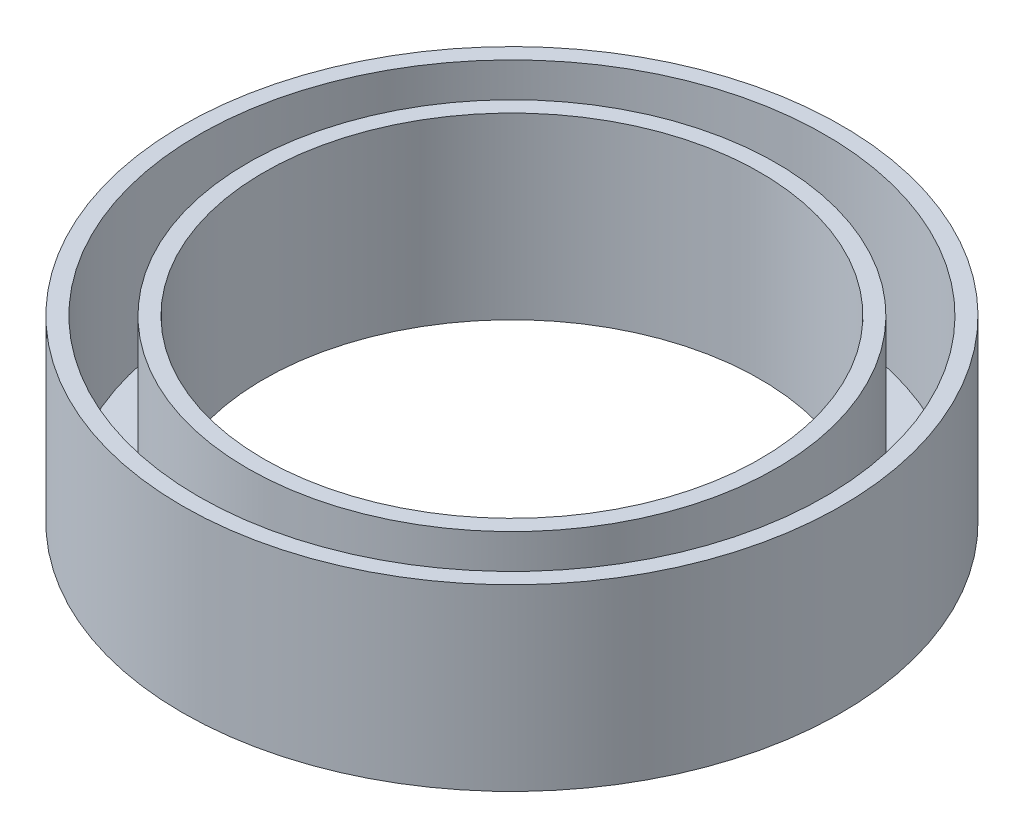
ISO-10303-21;
HEADER;
FILE_DESCRIPTION(('STEP AP214'),'2;1');
FILE_NAME('part.step','',(''),(''),'','','');
FILE_SCHEMA(('AUTOMOTIVE_DESIGN { 1 0 10303 214 1 1 1 1 }'));
ENDSEC;
DATA;
#1=APPLICATION_CONTEXT('core data for automotive mechanical design processes');
#2=APPLICATION_PROTOCOL_DEFINITION('international standard','automotive_design',2000,#1);
#3=PRODUCT_CONTEXT('',#1,'mechanical');
#4=PRODUCT('Part','Part','',(#3));
#5=PRODUCT_RELATED_PRODUCT_CATEGORY('part','',(#4));
#6=PRODUCT_DEFINITION_FORMATION('','',#4);
#7=PRODUCT_DEFINITION_CONTEXT('part definition',#1,'design');
#8=PRODUCT_DEFINITION('design','',#6,#7);
#9=PRODUCT_DEFINITION_SHAPE('','',#8);
#10=(LENGTH_UNIT() NAMED_UNIT(*) SI_UNIT(.MILLI.,.METRE.));
#11=(NAMED_UNIT(*) PLANE_ANGLE_UNIT() SI_UNIT($,.RADIAN.));
#12=(NAMED_UNIT(*) SI_UNIT($,.STERADIAN.) SOLID_ANGLE_UNIT());
#13=UNCERTAINTY_MEASURE_WITH_UNIT(LENGTH_MEASURE(1.E-05),#10,'distance_accuracy_value','');
#14=(GEOMETRIC_REPRESENTATION_CONTEXT(3) GLOBAL_UNCERTAINTY_ASSIGNED_CONTEXT((#13)) GLOBAL_UNIT_ASSIGNED_CONTEXT((#10,
#11,#12)) REPRESENTATION_CONTEXT('',''));
#15=CARTESIAN_POINT('',(0.,0.,0.));
#16=DIRECTION('',(0.,0.,1.));
#17=DIRECTION('',(1.,0.,0.));
#18=AXIS2_PLACEMENT_3D('',#15,#16,#17);
#19=CARTESIAN_POINT('',(0.,1.,0.));
#20=DIRECTION('',(0.,1.,0.));
#21=DIRECTION('',(0.,0.,1.));
#22=AXIS2_PLACEMENT_3D('',#19,#20,#21);
#23=PLANE('',#22);
#24=CARTESIAN_POINT('',(0.,1.,0.));
#25=DIRECTION('',(0.,1.,0.));
#26=DIRECTION('',(0.,0.,1.));
#27=AXIS2_PLACEMENT_3D('',#24,#25,#26);
#28=CIRCLE('',#27,19.25);
#29=CARTESIAN_POINT('',(0.,1.,19.25));
#30=VERTEX_POINT('',#29);
#31=EDGE_CURVE('E56',#30,#30,#28,.T.);
#32=ORIENTED_EDGE('',*,*,#31,.T.);
#33=EDGE_LOOP('',(#32));
#34=FACE_BOUND('',#33,.T.);
#35=CARTESIAN_POINT('',(0.,1.,0.));
#36=DIRECTION('',(0.,1.,0.));
#37=DIRECTION('',(0.,0.,1.));
#38=AXIS2_PLACEMENT_3D('',#35,#36,#37);
#39=CIRCLE('',#38,16.25);
#40=CARTESIAN_POINT('',(0.,1.,16.25));
#41=VERTEX_POINT('',#40);
#42=EDGE_CURVE('E11',#41,#41,#39,.T.);
#43=ORIENTED_EDGE('',*,*,#42,.F.);
#44=EDGE_LOOP('',(#43));
#45=FACE_BOUND('',#44,.T.);
#46=ADVANCED_FACE('F49',(#34,#45),#23,.T.);
#47=CARTESIAN_POINT('',(0.,0.,0.));
#48=DIRECTION('',(0.,1.,0.));
#49=DIRECTION('',(0.,0.,1.));
#50=AXIS2_PLACEMENT_3D('',#47,#48,#49);
#51=PLANE('',#50);
#52=CARTESIAN_POINT('',(0.,0.,0.));
#53=DIRECTION('',(0.,1.,0.));
#54=DIRECTION('',(0.,0.,1.));
#55=AXIS2_PLACEMENT_3D('',#52,#53,#54);
#56=CIRCLE('',#55,20.25);
#57=CARTESIAN_POINT('',(0.,0.,20.25));
#58=VERTEX_POINT('',#57);
#59=EDGE_CURVE('E60',#58,#58,#56,.T.);
#60=ORIENTED_EDGE('',*,*,#59,.F.);
#61=EDGE_LOOP('',(#60));
#62=FACE_BOUND('',#61,.T.);
#63=CARTESIAN_POINT('',(0.,0.,0.));
#64=DIRECTION('',(0.,1.,0.));
#65=DIRECTION('',(0.,0.,1.));
#66=AXIS2_PLACEMENT_3D('',#63,#64,#65);
#67=CIRCLE('',#66,15.25);
#68=CARTESIAN_POINT('',(0.,0.,15.25));
#69=VERTEX_POINT('',#68);
#70=EDGE_CURVE('E72',#69,#69,#67,.T.);
#71=ORIENTED_EDGE('',*,*,#70,.T.);
#72=EDGE_LOOP('',(#71));
#73=FACE_BOUND('',#72,.T.);
#74=ADVANCED_FACE('F51',(#62,#73),#51,.F.);
#75=CARTESIAN_POINT('',(0.,0.,0.));
#76=DIRECTION('',(0.,1.,0.));
#77=DIRECTION('',(0.,0.,1.));
#78=AXIS2_PLACEMENT_3D('',#75,#76,#77);
#79=CYLINDRICAL_SURFACE('',#78,19.25);
#80=ORIENTED_EDGE('',*,*,#31,.F.);
#81=EDGE_LOOP('',(#80));
#82=FACE_BOUND('',#81,.T.);
#83=CARTESIAN_POINT('',(0.,11.,0.));
#84=DIRECTION('',(0.,1.,0.));
#85=DIRECTION('',(0.,0.,1.));
#86=AXIS2_PLACEMENT_3D('',#83,#84,#85);
#87=CIRCLE('',#86,19.25);
#88=CARTESIAN_POINT('',(0.,11.,19.25));
#89=VERTEX_POINT('',#88);
#90=EDGE_CURVE('E69',#89,#89,#87,.T.);
#91=ORIENTED_EDGE('',*,*,#90,.T.);
#92=EDGE_LOOP('',(#91));
#93=FACE_BOUND('',#92,.T.);
#94=ADVANCED_FACE('F103',(#82,#93),#79,.F.);
#95=CARTESIAN_POINT('',(0.,0.,0.));
#96=DIRECTION('',(0.,1.,0.));
#97=DIRECTION('',(0.,0.,1.));
#98=AXIS2_PLACEMENT_3D('',#95,#96,#97);
#99=CYLINDRICAL_SURFACE('',#98,20.25);
#100=ORIENTED_EDGE('',*,*,#59,.T.);
#101=EDGE_LOOP('',(#100));
#102=FACE_BOUND('',#101,.T.);
#103=CARTESIAN_POINT('',(0.,11.,0.));
#104=DIRECTION('',(0.,1.,0.));
#105=DIRECTION('',(0.,0.,1.));
#106=AXIS2_PLACEMENT_3D('',#103,#104,#105);
#107=CIRCLE('',#106,20.25);
#108=CARTESIAN_POINT('',(0.,11.,20.25));
#109=VERTEX_POINT('',#108);
#110=EDGE_CURVE('E64',#109,#109,#107,.T.);
#111=ORIENTED_EDGE('',*,*,#110,.F.);
#112=EDGE_LOOP('',(#111));
#113=FACE_BOUND('',#112,.T.);
#114=ADVANCED_FACE('F109',(#102,#113),#99,.T.);
#115=CARTESIAN_POINT('',(0.,11.,0.));
#116=DIRECTION('',(0.,1.,0.));
#117=DIRECTION('',(0.,0.,1.));
#118=AXIS2_PLACEMENT_3D('',#115,#116,#117);
#119=PLANE('',#118);
#120=ORIENTED_EDGE('',*,*,#90,.F.);
#121=EDGE_LOOP('',(#120));
#122=FACE_BOUND('',#121,.T.);
#123=ORIENTED_EDGE('',*,*,#110,.T.);
#124=EDGE_LOOP('',(#123));
#125=FACE_BOUND('',#124,.T.);
#126=ADVANCED_FACE('F96',(#122,#125),#119,.T.);
#127=CARTESIAN_POINT('',(0.,0.,0.));
#128=DIRECTION('',(0.,1.,0.));
#129=DIRECTION('',(0.,0.,1.));
#130=AXIS2_PLACEMENT_3D('',#127,#128,#129);
#131=CYLINDRICAL_SURFACE('',#130,15.25);
#132=ORIENTED_EDGE('',*,*,#70,.F.);
#133=EDGE_LOOP('',(#132));
#134=FACE_BOUND('',#133,.T.);
#135=CARTESIAN_POINT('',(0.,11.,0.));
#136=DIRECTION('',(0.,1.,0.));
#137=DIRECTION('',(0.,0.,1.));
#138=AXIS2_PLACEMENT_3D('',#135,#136,#137);
#139=CIRCLE('',#138,15.25);
#140=CARTESIAN_POINT('',(0.,11.,15.25));
#141=VERTEX_POINT('',#140);
#142=EDGE_CURVE('E78',#141,#141,#139,.T.);
#143=ORIENTED_EDGE('',*,*,#142,.T.);
#144=EDGE_LOOP('',(#143));
#145=FACE_BOUND('',#144,.T.);
#146=ADVANCED_FACE('F82',(#134,#145),#131,.F.);
#147=CARTESIAN_POINT('',(0.,0.,0.));
#148=DIRECTION('',(0.,1.,0.));
#149=DIRECTION('',(0.,0.,1.));
#150=AXIS2_PLACEMENT_3D('',#147,#148,#149);
#151=CYLINDRICAL_SURFACE('',#150,16.25);
#152=ORIENTED_EDGE('',*,*,#42,.T.);
#153=EDGE_LOOP('',(#152));
#154=FACE_BOUND('',#153,.T.);
#155=CARTESIAN_POINT('',(0.,11.,0.));
#156=DIRECTION('',(0.,1.,0.));
#157=DIRECTION('',(0.,0.,1.));
#158=AXIS2_PLACEMENT_3D('',#155,#156,#157);
#159=CIRCLE('',#158,16.25);
#160=CARTESIAN_POINT('',(0.,11.,16.25));
#161=VERTEX_POINT('',#160);
#162=EDGE_CURVE('E75',#161,#161,#159,.F.);
#163=ORIENTED_EDGE('',*,*,#162,.T.);
#164=EDGE_LOOP('',(#163));
#165=FACE_BOUND('',#164,.T.);
#166=ADVANCED_FACE('F87',(#154,#165),#151,.T.);
#167=CARTESIAN_POINT('',(0.,11.,0.));
#168=DIRECTION('',(0.,1.,0.));
#169=DIRECTION('',(0.,0.,1.));
#170=AXIS2_PLACEMENT_3D('',#167,#168,#169);
#171=PLANE('',#170);
#172=ORIENTED_EDGE('',*,*,#142,.F.);
#173=EDGE_LOOP('',(#172));
#174=FACE_BOUND('',#173,.T.);
#175=ORIENTED_EDGE('',*,*,#162,.F.);
#176=EDGE_LOOP('',(#175));
#177=FACE_BOUND('',#176,.T.);
#178=ADVANCED_FACE('F84',(#174,#177),#171,.T.);
#179=CLOSED_SHELL('',(#46,#74,#94,#114,#126,#146,#166,#178));
#180=MANIFOLD_SOLID_BREP('B2',#179);
#181=ADVANCED_BREP_SHAPE_REPRESENTATION('',(#18,#180),#14);
#182=SHAPE_DEFINITION_REPRESENTATION(#9,#181);
ENDSEC;
END-ISO-10303-21;
